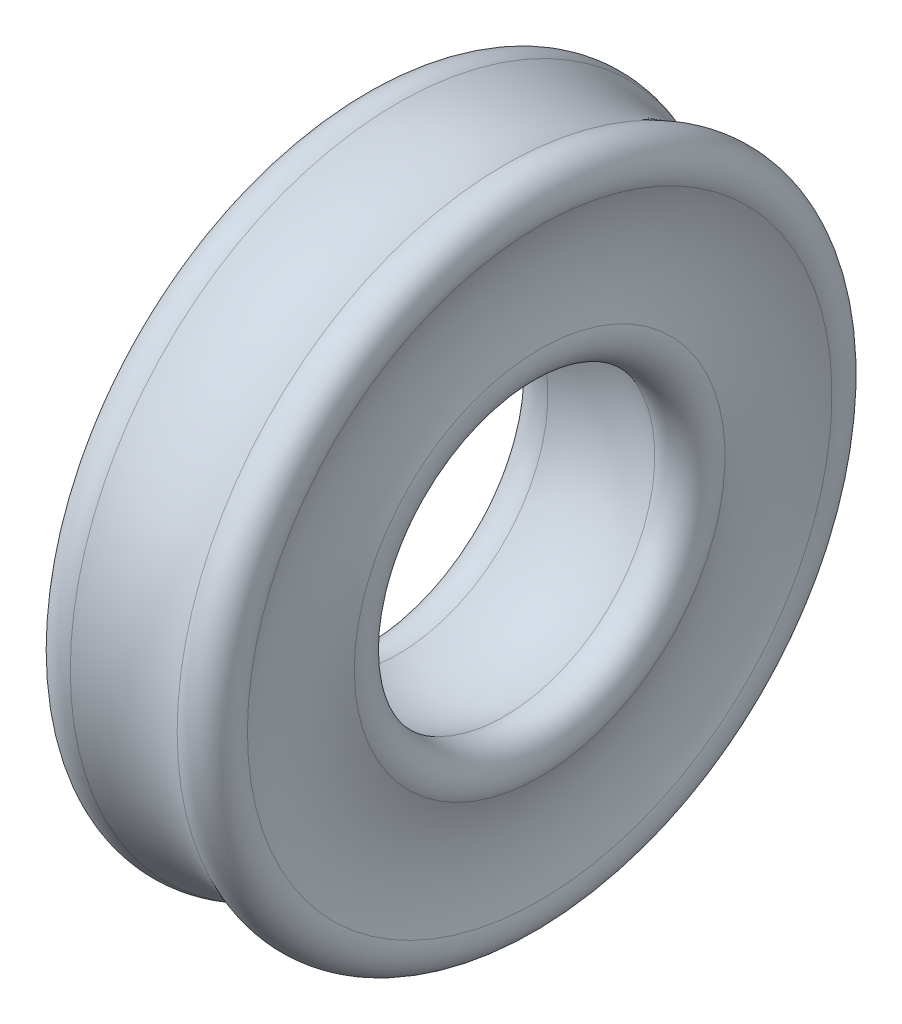
ISO-10303-21;
HEADER;
FILE_DESCRIPTION(('STEP AP214'),'2;1');
FILE_NAME('part.step','',(''),(''),'','','');
FILE_SCHEMA(('AUTOMOTIVE_DESIGN { 1 0 10303 214 1 1 1 1 }'));
ENDSEC;
DATA;
#1=APPLICATION_CONTEXT('core data for automotive mechanical design processes');
#2=APPLICATION_PROTOCOL_DEFINITION('international standard','automotive_design',2000,#1);
#3=PRODUCT_CONTEXT('',#1,'mechanical');
#4=PRODUCT('Part','Part','',(#3));
#5=PRODUCT_RELATED_PRODUCT_CATEGORY('part','',(#4));
#6=PRODUCT_DEFINITION_FORMATION('','',#4);
#7=PRODUCT_DEFINITION_CONTEXT('part definition',#1,'design');
#8=PRODUCT_DEFINITION('design','',#6,#7);
#9=PRODUCT_DEFINITION_SHAPE('','',#8);
#10=(LENGTH_UNIT() NAMED_UNIT(*) SI_UNIT(.MILLI.,.METRE.));
#11=(NAMED_UNIT(*) PLANE_ANGLE_UNIT() SI_UNIT($,.RADIAN.));
#12=(NAMED_UNIT(*) SI_UNIT($,.STERADIAN.) SOLID_ANGLE_UNIT());
#13=UNCERTAINTY_MEASURE_WITH_UNIT(LENGTH_MEASURE(1.E-05),#10,'distance_accuracy_value','');
#14=(GEOMETRIC_REPRESENTATION_CONTEXT(3) GLOBAL_UNCERTAINTY_ASSIGNED_CONTEXT((#13)) GLOBAL_UNIT_ASSIGNED_CONTEXT((#10,
#11,#12)) REPRESENTATION_CONTEXT('',''));
#15=CARTESIAN_POINT('',(0.,0.,0.));
#16=DIRECTION('',(0.,0.,1.));
#17=DIRECTION('',(1.,0.,0.));
#18=AXIS2_PLACEMENT_3D('',#15,#16,#17);
#19=CARTESIAN_POINT('',(-0.628617928474841,0.,0.));
#20=DIRECTION('',(-1.,0.,0.));
#21=DIRECTION('',(0.,0.,1.));
#22=AXIS2_PLACEMENT_3D('',#19,#20,#21);
#23=TOROIDAL_SURFACE('',#22,2.96541792847484,0.260382071525159);
#24=CARTESIAN_POINT('',(-0.8665747498208,0.,0.));
#25=DIRECTION('',(-1.,0.,0.));
#26=DIRECTION('',(0.,0.,1.));
#27=AXIS2_PLACEMENT_3D('',#24,#25,#26);
#28=CIRCLE('',#27,2.85970428533139);
#29=CARTESIAN_POINT('',(-0.8665747498208,0.,2.85970428533139));
#30=VERTEX_POINT('',#29);
#31=EDGE_CURVE('E65',#30,#30,#28,.T.);
#32=ORIENTED_EDGE('',*,*,#31,.F.);
#33=EDGE_LOOP('',(#32));
#34=FACE_BOUND('',#33,.T.);
#35=CARTESIAN_POINT('',(-0.522904285331392,0.,0.));
#36=DIRECTION('',(-1.,0.,0.));
#37=DIRECTION('',(0.,0.,1.));
#38=AXIS2_PLACEMENT_3D('',#35,#36,#37);
#39=CIRCLE('',#38,3.2033747498208);
#40=CARTESIAN_POINT('',(-0.522904285331392,0.,3.2033747498208));
#41=VERTEX_POINT('',#40);
#42=EDGE_CURVE('E11',#41,#41,#39,.T.);
#43=ORIENTED_EDGE('',*,*,#42,.T.);
#44=EDGE_LOOP('',(#43));
#45=FACE_BOUND('',#44,.T.);
#46=ADVANCED_FACE('F37',(#34,#45),#23,.T.);
#47=CARTESIAN_POINT('',(0.,0.,0.));
#48=DIRECTION('',(-1.,0.,0.));
#49=DIRECTION('',(0.,0.,1.));
#50=AXIS2_PLACEMENT_3D('',#47,#48,#49);
#51=TOROIDAL_SURFACE('',#50,4.38040959514151,1.28795959514151);
#52=ORIENTED_EDGE('',*,*,#42,.F.);
#53=EDGE_LOOP('',(#52));
#54=FACE_BOUND('',#53,.T.);
#55=CARTESIAN_POINT('',(0.522904285331391,0.,0.));
#56=DIRECTION('',(-1.,0.,0.));
#57=DIRECTION('',(0.,0.,1.));
#58=AXIS2_PLACEMENT_3D('',#55,#56,#57);
#59=CIRCLE('',#58,3.2033747498208);
#60=CARTESIAN_POINT('',(0.522904285331391,0.,3.2033747498208));
#61=VERTEX_POINT('',#60);
#62=EDGE_CURVE('E43',#61,#61,#59,.T.);
#63=ORIENTED_EDGE('',*,*,#62,.T.);
#64=EDGE_LOOP('',(#63));
#65=FACE_BOUND('',#64,.T.);
#66=ADVANCED_FACE('F72',(#54,#65),#51,.F.);
#67=CARTESIAN_POINT('',(0.62861792847484,0.,0.));
#68=DIRECTION('',(-1.,0.,0.));
#69=DIRECTION('',(0.,0.,1.));
#70=AXIS2_PLACEMENT_3D('',#67,#68,#69);
#71=TOROIDAL_SURFACE('',#70,2.96541792847484,0.26038207152516);
#72=ORIENTED_EDGE('',*,*,#62,.F.);
#73=EDGE_LOOP('',(#72));
#74=FACE_BOUND('',#73,.T.);
#75=CARTESIAN_POINT('',(0.8665747498208,0.,0.));
#76=DIRECTION('',(-1.,0.,0.));
#77=DIRECTION('',(0.,0.,1.));
#78=AXIS2_PLACEMENT_3D('',#75,#76,#77);
#79=CIRCLE('',#78,2.85970428533139);
#80=CARTESIAN_POINT('',(0.8665747498208,0.,2.85970428533139));
#81=VERTEX_POINT('',#80);
#82=EDGE_CURVE('E47',#81,#81,#79,.T.);
#83=ORIENTED_EDGE('',*,*,#82,.T.);
#84=EDGE_LOOP('',(#83));
#85=FACE_BOUND('',#84,.T.);
#86=ADVANCED_FACE('F76',(#74,#85),#71,.T.);
#87=CARTESIAN_POINT('',(2.04360959514151,0.,0.));
#88=DIRECTION('',(-1.,0.,0.));
#89=DIRECTION('',(0.,0.,1.));
#90=AXIS2_PLACEMENT_3D('',#87,#88,#89);
#91=TOROIDAL_SURFACE('',#90,2.3368,1.28795959514151);
#92=ORIENTED_EDGE('',*,*,#82,.F.);
#93=EDGE_LOOP('',(#92));
#94=FACE_BOUND('',#93,.T.);
#95=CARTESIAN_POINT('',(0.866574749820799,0.,0.));
#96=DIRECTION('',(-1.,0.,0.));
#97=DIRECTION('',(0.,0.,1.));
#98=AXIS2_PLACEMENT_3D('',#95,#96,#97);
#99=CIRCLE('',#98,1.81389571466861);
#100=CARTESIAN_POINT('',(0.866574749820799,0.,1.81389571466861));
#101=VERTEX_POINT('',#100);
#102=EDGE_CURVE('E51',#101,#101,#99,.T.);
#103=ORIENTED_EDGE('',*,*,#102,.T.);
#104=EDGE_LOOP('',(#103));
#105=FACE_BOUND('',#104,.T.);
#106=ADVANCED_FACE('F81',(#94,#105),#91,.F.);
#107=CARTESIAN_POINT('',(0.628617928474839,0.,0.));
#108=DIRECTION('',(-1.,0.,0.));
#109=DIRECTION('',(0.,0.,1.));
#110=AXIS2_PLACEMENT_3D('',#107,#108,#109);
#111=TOROIDAL_SURFACE('',#110,1.70818207152516,0.260382071525161);
#112=ORIENTED_EDGE('',*,*,#102,.F.);
#113=EDGE_LOOP('',(#112));
#114=FACE_BOUND('',#113,.T.);
#115=CARTESIAN_POINT('',(0.52290428533139,0.,0.));
#116=DIRECTION('',(-1.,0.,0.));
#117=DIRECTION('',(0.,0.,1.));
#118=AXIS2_PLACEMENT_3D('',#115,#116,#117);
#119=CIRCLE('',#118,1.4702252501792);
#120=CARTESIAN_POINT('',(0.52290428533139,0.,1.4702252501792));
#121=VERTEX_POINT('',#120);
#122=EDGE_CURVE('E56',#121,#121,#119,.T.);
#123=ORIENTED_EDGE('',*,*,#122,.T.);
#124=EDGE_LOOP('',(#123));
#125=FACE_BOUND('',#124,.T.);
#126=ADVANCED_FACE('F87',(#114,#125),#111,.T.);
#127=CARTESIAN_POINT('',(0.,0.,0.));
#128=DIRECTION('',(-1.,0.,0.));
#129=DIRECTION('',(0.,0.,1.));
#130=AXIS2_PLACEMENT_3D('',#127,#128,#129);
#131=DEGENERATE_TOROIDAL_SURFACE('',#130,0.29319040485849,1.28795959514151,.T.);
#132=ORIENTED_EDGE('',*,*,#122,.F.);
#133=EDGE_LOOP('',(#132));
#134=FACE_BOUND('',#133,.T.);
#135=CARTESIAN_POINT('',(-0.522904285331391,0.,0.));
#136=DIRECTION('',(-1.,0.,0.));
#137=DIRECTION('',(0.,0.,1.));
#138=AXIS2_PLACEMENT_3D('',#135,#136,#137);
#139=CIRCLE('',#138,1.4702252501792);
#140=CARTESIAN_POINT('',(-0.522904285331391,0.,1.4702252501792));
#141=VERTEX_POINT('',#140);
#142=EDGE_CURVE('E59',#141,#141,#139,.T.);
#143=ORIENTED_EDGE('',*,*,#142,.T.);
#144=EDGE_LOOP('',(#143));
#145=FACE_BOUND('',#144,.T.);
#146=ADVANCED_FACE('F91',(#134,#145),#131,.F.);
#147=CARTESIAN_POINT('',(-0.62861792847484,0.,0.));
#148=DIRECTION('',(-1.,0.,0.));
#149=DIRECTION('',(0.,0.,1.));
#150=AXIS2_PLACEMENT_3D('',#147,#148,#149);
#151=TOROIDAL_SURFACE('',#150,1.70818207152516,0.26038207152516);
#152=ORIENTED_EDGE('',*,*,#142,.F.);
#153=EDGE_LOOP('',(#152));
#154=FACE_BOUND('',#153,.T.);
#155=CARTESIAN_POINT('',(-0.8665747498208,0.,0.));
#156=DIRECTION('',(-1.,0.,0.));
#157=DIRECTION('',(0.,0.,1.));
#158=AXIS2_PLACEMENT_3D('',#155,#156,#157);
#159=CIRCLE('',#158,1.81389571466861);
#160=CARTESIAN_POINT('',(-0.8665747498208,0.,1.81389571466861));
#161=VERTEX_POINT('',#160);
#162=EDGE_CURVE('E62',#161,#161,#159,.T.);
#163=ORIENTED_EDGE('',*,*,#162,.T.);
#164=EDGE_LOOP('',(#163));
#165=FACE_BOUND('',#164,.T.);
#166=ADVANCED_FACE('F95',(#154,#165),#151,.T.);
#167=CARTESIAN_POINT('',(-2.04360959514151,0.,0.));
#168=DIRECTION('',(-1.,0.,0.));
#169=DIRECTION('',(0.,0.,1.));
#170=AXIS2_PLACEMENT_3D('',#167,#168,#169);
#171=TOROIDAL_SURFACE('',#170,2.3368,1.28795959514151);
#172=ORIENTED_EDGE('',*,*,#162,.F.);
#173=EDGE_LOOP('',(#172));
#174=FACE_BOUND('',#173,.T.);
#175=ORIENTED_EDGE('',*,*,#31,.T.);
#176=EDGE_LOOP('',(#175));
#177=FACE_BOUND('',#176,.T.);
#178=ADVANCED_FACE('F69',(#174,#177),#171,.F.);
#179=CLOSED_SHELL('',(#46,#66,#86,#106,#126,#146,#166,#178));
#180=MANIFOLD_SOLID_BREP('B2',#179);
#181=ADVANCED_BREP_SHAPE_REPRESENTATION('',(#18,#180),#14);
#182=SHAPE_DEFINITION_REPRESENTATION(#9,#181);
ENDSEC;
END-ISO-10303-21;
